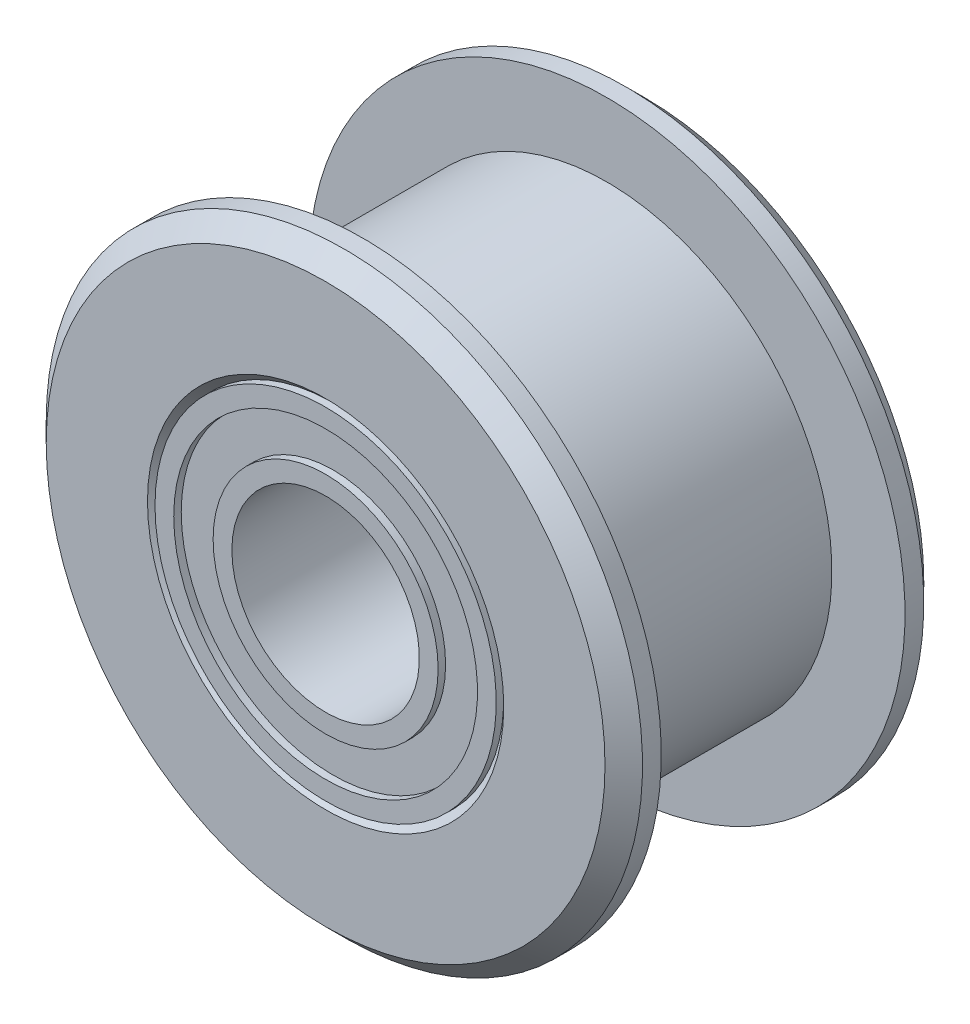
ISO-10303-21;
HEADER;
FILE_DESCRIPTION(('STEP AP214'),'2;1');
FILE_NAME('part.step','',(''),(''),'','','');
FILE_SCHEMA(('AUTOMOTIVE_DESIGN { 1 0 10303 214 1 1 1 1 }'));
ENDSEC;
DATA;
#1=APPLICATION_CONTEXT('core data for automotive mechanical design processes');
#2=APPLICATION_PROTOCOL_DEFINITION('international standard','automotive_design',2000,#1);
#3=PRODUCT_CONTEXT('',#1,'mechanical');
#4=PRODUCT('Part','Part','',(#3));
#5=PRODUCT_RELATED_PRODUCT_CATEGORY('part','',(#4));
#6=PRODUCT_DEFINITION_FORMATION('','',#4);
#7=PRODUCT_DEFINITION_CONTEXT('part definition',#1,'design');
#8=PRODUCT_DEFINITION('design','',#6,#7);
#9=PRODUCT_DEFINITION_SHAPE('','',#8);
#10=(LENGTH_UNIT() NAMED_UNIT(*) SI_UNIT(.MILLI.,.METRE.));
#11=(NAMED_UNIT(*) PLANE_ANGLE_UNIT() SI_UNIT($,.RADIAN.));
#12=(NAMED_UNIT(*) SI_UNIT($,.STERADIAN.) SOLID_ANGLE_UNIT());
#13=UNCERTAINTY_MEASURE_WITH_UNIT(LENGTH_MEASURE(1.E-05),#10,'distance_accuracy_value','');
#14=(GEOMETRIC_REPRESENTATION_CONTEXT(3) GLOBAL_UNCERTAINTY_ASSIGNED_CONTEXT((#13)) GLOBAL_UNIT_ASSIGNED_CONTEXT((#10,
#11,#12)) REPRESENTATION_CONTEXT('',''));
#15=CARTESIAN_POINT('',(0.,0.,0.));
#16=DIRECTION('',(0.,0.,1.));
#17=DIRECTION('',(1.,0.,0.));
#18=AXIS2_PLACEMENT_3D('',#15,#16,#17);
#19=CARTESIAN_POINT('',(0.,0.,6.5));
#20=DIRECTION('',(0.,0.,-1.));
#21=DIRECTION('',(0.,-1.,0.));
#22=AXIS2_PLACEMENT_3D('',#19,#20,#21);
#23=PLANE('',#22);
#24=CARTESIAN_POINT('',(0.,0.,6.5));
#25=DIRECTION('',(0.,0.,1.));
#26=DIRECTION('',(1.,0.,0.));
#27=AXIS2_PLACEMENT_3D('',#24,#25,#26);
#28=CIRCLE('',#27,6.);
#29=CARTESIAN_POINT('',(-6.,0.,6.5));
#30=VERTEX_POINT('',#29);
#31=EDGE_CURVE('E263',#30,#30,#28,.T.);
#32=ORIENTED_EDGE('',*,*,#31,.T.);
#33=EDGE_LOOP('',(#32));
#34=FACE_BOUND('',#33,.T.);
#35=CARTESIAN_POINT('',(0.,0.,6.5));
#36=DIRECTION('',(0.,0.,1.));
#37=DIRECTION('',(1.,0.,0.));
#38=AXIS2_PLACEMENT_3D('',#35,#36,#37);
#39=CIRCLE('',#38,7.95);
#40=CARTESIAN_POINT('',(-7.95,0.,6.5));
#41=VERTEX_POINT('',#40);
#42=EDGE_CURVE('E179',#41,#41,#39,.T.);
#43=ORIENTED_EDGE('',*,*,#42,.F.);
#44=EDGE_LOOP('',(#43));
#45=FACE_BOUND('',#44,.T.);
#46=ADVANCED_FACE('F19',(#34,#45),#23,.T.);
#47=CARTESIAN_POINT('',(0.,0.,0.));
#48=DIRECTION('',(0.,0.,1.));
#49=DIRECTION('',(1.,0.,0.));
#50=AXIS2_PLACEMENT_3D('',#47,#48,#49);
#51=CYLINDRICAL_SURFACE('',#50,2.5);
#52=CARTESIAN_POINT('',(0.,0.,7.5));
#53=DIRECTION('',(0.,0.,-1.));
#54=DIRECTION('',(1.,0.,0.));
#55=AXIS2_PLACEMENT_3D('',#52,#53,#54);
#56=CIRCLE('',#55,2.5);
#57=CARTESIAN_POINT('',(-2.5,0.,7.5));
#58=VERTEX_POINT('',#57);
#59=EDGE_CURVE('E167',#58,#58,#56,.T.);
#60=ORIENTED_EDGE('',*,*,#59,.F.);
#61=DIRECTION('',(0.,0.,-1.));
#62=VECTOR('',#61,1.);
#63=CARTESIAN_POINT('',(-2.5,0.,0.));
#64=LINE('',#63,#62);
#65=CARTESIAN_POINT('',(-2.5,0.,-1.));
#66=VERTEX_POINT('',#65);
#67=EDGE_CURVE('E11',#58,#66,#64,.T.);
#68=ORIENTED_EDGE('',*,*,#67,.T.);
#69=CARTESIAN_POINT('',(0.,0.,-1.));
#70=DIRECTION('',(0.,0.,-1.));
#71=DIRECTION('',(1.,0.,0.));
#72=AXIS2_PLACEMENT_3D('',#69,#70,#71);
#73=CIRCLE('',#72,2.5);
#74=EDGE_CURVE('E162',#66,#66,#73,.T.);
#75=ORIENTED_EDGE('',*,*,#74,.T.);
#76=ORIENTED_EDGE('',*,*,#67,.F.);
#77=EDGE_LOOP('',(#60,#68,#75,#76));
#78=FACE_BOUND('',#77,.T.);
#79=ADVANCED_FACE('F291',(#78),#51,.F.);
#80=CARTESIAN_POINT('',(0.,0.,7.5));
#81=DIRECTION('',(0.,0.,-1.));
#82=DIRECTION('',(1.,0.,0.));
#83=AXIS2_PLACEMENT_3D('',#80,#81,#82);
#84=CYLINDRICAL_SURFACE('',#83,3.);
#85=CARTESIAN_POINT('',(0.,0.,7.5));
#86=DIRECTION('',(0.,0.,1.));
#87=DIRECTION('',(1.,0.,0.));
#88=AXIS2_PLACEMENT_3D('',#85,#86,#87);
#89=CIRCLE('',#88,3.);
#90=CARTESIAN_POINT('',(-3.,0.,7.5));
#91=VERTEX_POINT('',#90);
#92=EDGE_CURVE('E164',#91,#91,#89,.T.);
#93=ORIENTED_EDGE('',*,*,#92,.F.);
#94=DIRECTION('',(0.,0.,-1.));
#95=VECTOR('',#94,1.);
#96=CARTESIAN_POINT('',(-3.,0.,7.5));
#97=LINE('',#96,#95);
#98=CARTESIAN_POINT('',(-3.,0.,7.3));
#99=VERTEX_POINT('',#98);
#100=EDGE_CURVE('E29',#91,#99,#97,.T.);
#101=ORIENTED_EDGE('',*,*,#100,.T.);
#102=CARTESIAN_POINT('',(0.,0.,7.3));
#103=DIRECTION('',(0.,0.,1.));
#104=DIRECTION('',(1.,0.,0.));
#105=AXIS2_PLACEMENT_3D('',#102,#103,#104);
#106=CIRCLE('',#105,3.);
#107=EDGE_CURVE('E251',#99,#99,#106,.T.);
#108=ORIENTED_EDGE('',*,*,#107,.T.);
#109=ORIENTED_EDGE('',*,*,#100,.F.);
#110=EDGE_LOOP('',(#93,#101,#108,#109));
#111=FACE_BOUND('',#110,.T.);
#112=ADVANCED_FACE('F333',(#111),#84,.T.);
#113=CARTESIAN_POINT('',(0.,0.,7.5));
#114=DIRECTION('',(0.,0.,-1.));
#115=DIRECTION('',(1.,0.,0.));
#116=AXIS2_PLACEMENT_3D('',#113,#114,#115);
#117=CYLINDRICAL_SURFACE('',#116,4.05);
#118=CARTESIAN_POINT('',(0.,0.,7.5));
#119=DIRECTION('',(0.,0.,-1.));
#120=DIRECTION('',(1.,0.,0.));
#121=AXIS2_PLACEMENT_3D('',#118,#119,#120);
#122=CIRCLE('',#121,4.05);
#123=CARTESIAN_POINT('',(-4.05,0.,7.5));
#124=VERTEX_POINT('',#123);
#125=EDGE_CURVE('E229',#124,#124,#122,.T.);
#126=ORIENTED_EDGE('',*,*,#125,.F.);
#127=DIRECTION('',(0.,0.,-1.));
#128=VECTOR('',#127,1.);
#129=CARTESIAN_POINT('',(-4.05,0.,7.5));
#130=LINE('',#129,#128);
#131=CARTESIAN_POINT('',(-4.05,0.,7.3));
#132=VERTEX_POINT('',#131);
#133=EDGE_CURVE('E172',#124,#132,#130,.T.);
#134=ORIENTED_EDGE('',*,*,#133,.T.);
#135=CARTESIAN_POINT('',(0.,0.,7.3));
#136=DIRECTION('',(0.,0.,-1.));
#137=DIRECTION('',(1.,0.,0.));
#138=AXIS2_PLACEMENT_3D('',#135,#136,#137);
#139=CIRCLE('',#138,4.05);
#140=EDGE_CURVE('E240',#132,#132,#139,.T.);
#141=ORIENTED_EDGE('',*,*,#140,.T.);
#142=ORIENTED_EDGE('',*,*,#133,.F.);
#143=EDGE_LOOP('',(#126,#134,#141,#142));
#144=FACE_BOUND('',#143,.T.);
#145=ADVANCED_FACE('F324',(#144),#117,.F.);
#146=CARTESIAN_POINT('',(0.,0.,7.3));
#147=DIRECTION('',(0.,0.,1.));
#148=DIRECTION('',(1.,0.,0.));
#149=AXIS2_PLACEMENT_3D('',#146,#147,#148);
#150=PLANE('',#149);
#151=ORIENTED_EDGE('',*,*,#107,.F.);
#152=EDGE_LOOP('',(#151));
#153=FACE_BOUND('',#152,.T.);
#154=ORIENTED_EDGE('',*,*,#140,.F.);
#155=EDGE_LOOP('',(#154));
#156=FACE_BOUND('',#155,.T.);
#157=ADVANCED_FACE('F315',(#153,#156),#150,.T.);
#158=CARTESIAN_POINT('',(0.,0.,7.5));
#159=DIRECTION('',(0.,0.,1.));
#160=DIRECTION('',(1.,0.,0.));
#161=AXIS2_PLACEMENT_3D('',#158,#159,#160);
#162=PLANE('',#161);
#163=ORIENTED_EDGE('',*,*,#125,.T.);
#164=EDGE_LOOP('',(#163));
#165=FACE_BOUND('',#164,.T.);
#166=CARTESIAN_POINT('',(0.,0.,7.5));
#167=DIRECTION('',(0.,0.,1.));
#168=DIRECTION('',(1.,0.,0.));
#169=AXIS2_PLACEMENT_3D('',#166,#167,#168);
#170=CIRCLE('',#169,4.55);
#171=CARTESIAN_POINT('',(-4.55,0.,7.5));
#172=VERTEX_POINT('',#171);
#173=EDGE_CURVE('E215',#172,#172,#170,.T.);
#174=ORIENTED_EDGE('',*,*,#173,.T.);
#175=EDGE_LOOP('',(#174));
#176=FACE_BOUND('',#175,.T.);
#177=ADVANCED_FACE('F313',(#165,#176),#162,.T.);
#178=CARTESIAN_POINT('',(0.,0.,7.4));
#179=DIRECTION('',(0.,0.,1.));
#180=DIRECTION('',(1.,0.,0.));
#181=AXIS2_PLACEMENT_3D('',#178,#179,#180);
#182=CONICAL_SURFACE('',#181,4.65,0.785398163397448);
#183=CARTESIAN_POINT('',(0.,0.,7.5));
#184=DIRECTION('',(0.,0.,-1.));
#185=DIRECTION('',(1.,0.,0.));
#186=AXIS2_PLACEMENT_3D('',#183,#184,#185);
#187=CIRCLE('',#186,4.75);
#188=CARTESIAN_POINT('',(-4.75,0.,7.5));
#189=VERTEX_POINT('',#188);
#190=EDGE_CURVE('E181',#189,#189,#187,.T.);
#191=ORIENTED_EDGE('',*,*,#190,.F.);
#192=DIRECTION('',(0.707106781186548,0.,-0.707106781186548));
#193=VECTOR('',#192,1.);
#194=CARTESIAN_POINT('',(-4.65,0.,7.4));
#195=LINE('',#194,#193);
#196=CARTESIAN_POINT('',(-4.55,0.,7.3));
#197=VERTEX_POINT('',#196);
#198=EDGE_CURVE('E227',#189,#197,#195,.T.);
#199=ORIENTED_EDGE('',*,*,#198,.T.);
#200=CARTESIAN_POINT('',(0.,0.,7.3));
#201=DIRECTION('',(0.,0.,1.));
#202=DIRECTION('',(1.,0.,0.));
#203=AXIS2_PLACEMENT_3D('',#200,#201,#202);
#204=CIRCLE('',#203,4.55);
#205=EDGE_CURVE('E230',#197,#197,#204,.T.);
#206=ORIENTED_EDGE('',*,*,#205,.F.);
#207=ORIENTED_EDGE('',*,*,#198,.F.);
#208=EDGE_LOOP('',(#191,#199,#206,#207));
#209=FACE_BOUND('',#208,.T.);
#210=ADVANCED_FACE('F309',(#209),#182,.F.);
#211=CARTESIAN_POINT('',(0.,0.,7.5));
#212=DIRECTION('',(0.,0.,-1.));
#213=DIRECTION('',(1.,0.,0.));
#214=AXIS2_PLACEMENT_3D('',#211,#212,#213);
#215=CYLINDRICAL_SURFACE('',#214,4.55);
#216=ORIENTED_EDGE('',*,*,#173,.F.);
#217=DIRECTION('',(0.,0.,-1.));
#218=VECTOR('',#217,1.);
#219=CARTESIAN_POINT('',(-4.55,0.,7.5));
#220=LINE('',#219,#218);
#221=EDGE_CURVE('E219',#172,#197,#220,.T.);
#222=ORIENTED_EDGE('',*,*,#221,.T.);
#223=ORIENTED_EDGE('',*,*,#205,.T.);
#224=ORIENTED_EDGE('',*,*,#221,.F.);
#225=EDGE_LOOP('',(#216,#222,#223,#224));
#226=FACE_BOUND('',#225,.T.);
#227=ADVANCED_FACE('F311',(#226),#215,.T.);
#228=CARTESIAN_POINT('',(0.,0.,7.5));
#229=DIRECTION('',(0.,0.,1.));
#230=DIRECTION('',(1.,0.,0.));
#231=AXIS2_PLACEMENT_3D('',#228,#229,#230);
#232=PLANE('',#231);
#233=ORIENTED_EDGE('',*,*,#59,.T.);
#234=EDGE_LOOP('',(#233));
#235=FACE_BOUND('',#234,.T.);
#236=ORIENTED_EDGE('',*,*,#92,.T.);
#237=EDGE_LOOP('',(#236));
#238=FACE_BOUND('',#237,.T.);
#239=ADVANCED_FACE('F288',(#235,#238),#232,.T.);
#240=CARTESIAN_POINT('',(0.,0.,0.));
#241=DIRECTION('',(0.,0.,1.));
#242=DIRECTION('',(1.,0.,0.));
#243=AXIS2_PLACEMENT_3D('',#240,#241,#242);
#244=CYLINDRICAL_SURFACE('',#243,6.);
#245=ORIENTED_EDGE('',*,*,#31,.F.);
#246=DIRECTION('',(0.,0.,-1.));
#247=VECTOR('',#246,1.);
#248=CARTESIAN_POINT('',(-6.,0.,0.));
#249=LINE('',#248,#247);
#250=CARTESIAN_POINT('',(-6.,0.,0.));
#251=VERTEX_POINT('',#250);
#252=EDGE_CURVE('E168',#30,#251,#249,.T.);
#253=ORIENTED_EDGE('',*,*,#252,.T.);
#254=CARTESIAN_POINT('',(0.,0.,0.));
#255=DIRECTION('',(0.,0.,1.));
#256=DIRECTION('',(1.,0.,0.));
#257=AXIS2_PLACEMENT_3D('',#254,#255,#256);
#258=CIRCLE('',#257,6.);
#259=EDGE_CURVE('E163',#251,#251,#258,.T.);
#260=ORIENTED_EDGE('',*,*,#259,.T.);
#261=ORIENTED_EDGE('',*,*,#252,.F.);
#262=EDGE_LOOP('',(#245,#253,#260,#261));
#263=FACE_BOUND('',#262,.T.);
#264=ADVANCED_FACE('F338',(#263),#244,.T.);
#265=CARTESIAN_POINT('',(0.,0.,-1.));
#266=DIRECTION('',(0.,0.,-1.));
#267=DIRECTION('',(1.,0.,0.));
#268=AXIS2_PLACEMENT_3D('',#265,#266,#267);
#269=CYLINDRICAL_SURFACE('',#268,3.);
#270=CARTESIAN_POINT('',(0.,0.,-1.));
#271=DIRECTION('',(0.,0.,1.));
#272=DIRECTION('',(1.,0.,0.));
#273=AXIS2_PLACEMENT_3D('',#270,#271,#272);
#274=CIRCLE('',#273,3.);
#275=CARTESIAN_POINT('',(-3.,0.,-1.));
#276=VERTEX_POINT('',#275);
#277=EDGE_CURVE('E158',#276,#276,#274,.T.);
#278=ORIENTED_EDGE('',*,*,#277,.T.);
#279=DIRECTION('',(0.,0.,1.));
#280=VECTOR('',#279,1.);
#281=CARTESIAN_POINT('',(-3.,0.,-1.));
#282=LINE('',#281,#280);
#283=CARTESIAN_POINT('',(-3.,0.,-0.8));
#284=VERTEX_POINT('',#283);
#285=EDGE_CURVE('E226',#276,#284,#282,.T.);
#286=ORIENTED_EDGE('',*,*,#285,.T.);
#287=CARTESIAN_POINT('',(0.,0.,-0.8));
#288=DIRECTION('',(0.,0.,1.));
#289=DIRECTION('',(1.,0.,0.));
#290=AXIS2_PLACEMENT_3D('',#287,#288,#289);
#291=CIRCLE('',#290,3.);
#292=EDGE_CURVE('E202',#284,#284,#291,.T.);
#293=ORIENTED_EDGE('',*,*,#292,.F.);
#294=ORIENTED_EDGE('',*,*,#285,.F.);
#295=EDGE_LOOP('',(#278,#286,#293,#294));
#296=FACE_BOUND('',#295,.T.);
#297=ADVANCED_FACE('F369',(#296),#269,.T.);
#298=CARTESIAN_POINT('',(0.,0.,-1.));
#299=DIRECTION('',(0.,0.,-1.));
#300=DIRECTION('',(1.,0.,0.));
#301=AXIS2_PLACEMENT_3D('',#298,#299,#300);
#302=CYLINDRICAL_SURFACE('',#301,4.05);
#303=CARTESIAN_POINT('',(0.,0.,-1.));
#304=DIRECTION('',(0.,0.,-1.));
#305=DIRECTION('',(1.,0.,0.));
#306=AXIS2_PLACEMENT_3D('',#303,#304,#305);
#307=CIRCLE('',#306,4.05);
#308=CARTESIAN_POINT('',(-4.05,0.,-1.));
#309=VERTEX_POINT('',#308);
#310=EDGE_CURVE('E190',#309,#309,#307,.T.);
#311=ORIENTED_EDGE('',*,*,#310,.T.);
#312=DIRECTION('',(0.,0.,1.));
#313=VECTOR('',#312,1.);
#314=CARTESIAN_POINT('',(-4.05,0.,-1.));
#315=LINE('',#314,#313);
#316=CARTESIAN_POINT('',(-4.05,0.,-0.8));
#317=VERTEX_POINT('',#316);
#318=EDGE_CURVE('E223',#309,#317,#315,.T.);
#319=ORIENTED_EDGE('',*,*,#318,.T.);
#320=CARTESIAN_POINT('',(0.,0.,-0.8));
#321=DIRECTION('',(0.,0.,-1.));
#322=DIRECTION('',(1.,0.,0.));
#323=AXIS2_PLACEMENT_3D('',#320,#321,#322);
#324=CIRCLE('',#323,4.05);
#325=EDGE_CURVE('E193',#317,#317,#324,.T.);
#326=ORIENTED_EDGE('',*,*,#325,.F.);
#327=ORIENTED_EDGE('',*,*,#318,.F.);
#328=EDGE_LOOP('',(#311,#319,#326,#327));
#329=FACE_BOUND('',#328,.T.);
#330=ADVANCED_FACE('F21',(#329),#302,.F.);
#331=CARTESIAN_POINT('',(0.,0.,-0.8));
#332=DIRECTION('',(0.,0.,1.));
#333=DIRECTION('',(1.,0.,0.));
#334=AXIS2_PLACEMENT_3D('',#331,#332,#333);
#335=PLANE('',#334);
#336=ORIENTED_EDGE('',*,*,#292,.T.);
#337=EDGE_LOOP('',(#336));
#338=FACE_BOUND('',#337,.T.);
#339=ORIENTED_EDGE('',*,*,#325,.T.);
#340=EDGE_LOOP('',(#339));
#341=FACE_BOUND('',#340,.T.);
#342=ADVANCED_FACE('F468',(#338,#341),#335,.F.);
#343=CARTESIAN_POINT('',(0.,0.,-1.));
#344=DIRECTION('',(0.,0.,1.));
#345=DIRECTION('',(1.,0.,0.));
#346=AXIS2_PLACEMENT_3D('',#343,#344,#345);
#347=PLANE('',#346);
#348=ORIENTED_EDGE('',*,*,#310,.F.);
#349=EDGE_LOOP('',(#348));
#350=FACE_BOUND('',#349,.T.);
#351=CARTESIAN_POINT('',(0.,0.,-1.));
#352=DIRECTION('',(0.,0.,1.));
#353=DIRECTION('',(1.,0.,0.));
#354=AXIS2_PLACEMENT_3D('',#351,#352,#353);
#355=CIRCLE('',#354,4.55);
#356=CARTESIAN_POINT('',(-4.55,0.,-1.));
#357=VERTEX_POINT('',#356);
#358=EDGE_CURVE('E257',#357,#357,#355,.T.);
#359=ORIENTED_EDGE('',*,*,#358,.F.);
#360=EDGE_LOOP('',(#359));
#361=FACE_BOUND('',#360,.T.);
#362=ADVANCED_FACE('F359',(#350,#361),#347,.F.);
#363=CARTESIAN_POINT('',(0.,0.,-0.9));
#364=DIRECTION('',(0.,0.,-1.));
#365=DIRECTION('',(1.,0.,0.));
#366=AXIS2_PLACEMENT_3D('',#363,#364,#365);
#367=CONICAL_SURFACE('',#366,4.65,0.785398163397448);
#368=CARTESIAN_POINT('',(0.,0.,-1.));
#369=DIRECTION('',(0.,0.,-1.));
#370=DIRECTION('',(1.,0.,0.));
#371=AXIS2_PLACEMENT_3D('',#368,#369,#370);
#372=CIRCLE('',#371,4.75);
#373=CARTESIAN_POINT('',(-4.75,0.,-1.));
#374=VERTEX_POINT('',#373);
#375=EDGE_CURVE('E183',#374,#374,#372,.T.);
#376=ORIENTED_EDGE('',*,*,#375,.T.);
#377=DIRECTION('',(0.707106781186548,0.,0.707106781186548));
#378=VECTOR('',#377,1.);
#379=CARTESIAN_POINT('',(-4.65,0.,-0.9));
#380=LINE('',#379,#378);
#381=CARTESIAN_POINT('',(-4.55,0.,-0.8));
#382=VERTEX_POINT('',#381);
#383=EDGE_CURVE('E194',#374,#382,#380,.T.);
#384=ORIENTED_EDGE('',*,*,#383,.T.);
#385=CARTESIAN_POINT('',(0.,0.,-0.8));
#386=DIRECTION('',(0.,0.,1.));
#387=DIRECTION('',(1.,0.,0.));
#388=AXIS2_PLACEMENT_3D('',#385,#386,#387);
#389=CIRCLE('',#388,4.55);
#390=EDGE_CURVE('E204',#382,#382,#389,.T.);
#391=ORIENTED_EDGE('',*,*,#390,.T.);
#392=ORIENTED_EDGE('',*,*,#383,.F.);
#393=EDGE_LOOP('',(#376,#384,#391,#392));
#394=FACE_BOUND('',#393,.T.);
#395=ADVANCED_FACE('F505',(#394),#367,.F.);
#396=CARTESIAN_POINT('',(0.,0.,-1.));
#397=DIRECTION('',(0.,0.,-1.));
#398=DIRECTION('',(1.,0.,0.));
#399=AXIS2_PLACEMENT_3D('',#396,#397,#398);
#400=CYLINDRICAL_SURFACE('',#399,4.55);
#401=ORIENTED_EDGE('',*,*,#358,.T.);
#402=DIRECTION('',(0.,0.,1.));
#403=VECTOR('',#402,1.);
#404=CARTESIAN_POINT('',(-4.55,0.,-1.));
#405=LINE('',#404,#403);
#406=EDGE_CURVE('E211',#357,#382,#405,.T.);
#407=ORIENTED_EDGE('',*,*,#406,.T.);
#408=ORIENTED_EDGE('',*,*,#390,.F.);
#409=ORIENTED_EDGE('',*,*,#406,.F.);
#410=EDGE_LOOP('',(#401,#407,#408,#409));
#411=FACE_BOUND('',#410,.T.);
#412=ADVANCED_FACE('F500',(#411),#400,.T.);
#413=CARTESIAN_POINT('',(0.,0.,-1.));
#414=DIRECTION('',(0.,0.,1.));
#415=DIRECTION('',(1.,0.,0.));
#416=AXIS2_PLACEMENT_3D('',#413,#414,#415);
#417=PLANE('',#416);
#418=ORIENTED_EDGE('',*,*,#74,.F.);
#419=EDGE_LOOP('',(#418));
#420=FACE_BOUND('',#419,.T.);
#421=ORIENTED_EDGE('',*,*,#277,.F.);
#422=EDGE_LOOP('',(#421));
#423=FACE_BOUND('',#422,.T.);
#424=ADVANCED_FACE('F366',(#420,#423),#417,.F.);
#425=CARTESIAN_POINT('',(0.,0.,0.));
#426=DIRECTION('',(0.,0.,-1.));
#427=DIRECTION('',(0.,-1.,0.));
#428=AXIS2_PLACEMENT_3D('',#425,#426,#427);
#429=PLANE('',#428);
#430=ORIENTED_EDGE('',*,*,#259,.F.);
#431=EDGE_LOOP('',(#430));
#432=FACE_BOUND('',#431,.T.);
#433=CARTESIAN_POINT('',(0.,0.,0.));
#434=DIRECTION('',(0.,0.,1.));
#435=DIRECTION('',(1.,0.,0.));
#436=AXIS2_PLACEMENT_3D('',#433,#434,#435);
#437=CIRCLE('',#436,7.95);
#438=CARTESIAN_POINT('',(-7.95,0.,0.));
#439=VERTEX_POINT('',#438);
#440=EDGE_CURVE('E137',#439,#439,#437,.T.);
#441=ORIENTED_EDGE('',*,*,#440,.T.);
#442=EDGE_LOOP('',(#441));
#443=FACE_BOUND('',#442,.T.);
#444=ADVANCED_FACE('F364',(#432,#443),#429,.F.);
#445=CARTESIAN_POINT('',(0.,0.,7.5));
#446=DIRECTION('',(0.,0.,1.));
#447=DIRECTION('',(1.,0.,0.));
#448=AXIS2_PLACEMENT_3D('',#445,#446,#447);
#449=PLANE('',#448);
#450=ORIENTED_EDGE('',*,*,#190,.T.);
#451=EDGE_LOOP('',(#450));
#452=FACE_BOUND('',#451,.T.);
#453=CARTESIAN_POINT('',(0.,0.,7.5));
#454=DIRECTION('',(0.,0.,-1.));
#455=DIRECTION('',(1.,0.,0.));
#456=AXIS2_PLACEMENT_3D('',#453,#454,#455);
#457=CIRCLE('',#456,7.45);
#458=CARTESIAN_POINT('',(-7.45,0.,7.5));
#459=VERTEX_POINT('',#458);
#460=EDGE_CURVE('E187',#459,#459,#457,.T.);
#461=ORIENTED_EDGE('',*,*,#460,.F.);
#462=EDGE_LOOP('',(#461));
#463=FACE_BOUND('',#462,.T.);
#464=ADVANCED_FACE('F307',(#452,#463),#449,.T.);
#465=CARTESIAN_POINT('',(0.,0.,6.5));
#466=DIRECTION('',(0.,0.,1.));
#467=DIRECTION('',(1.,0.,0.));
#468=AXIS2_PLACEMENT_3D('',#465,#466,#467);
#469=CYLINDRICAL_SURFACE('',#468,7.95);
#470=CARTESIAN_POINT('',(0.,0.,7.));
#471=DIRECTION('',(0.,0.,1.));
#472=DIRECTION('',(1.,0.,0.));
#473=AXIS2_PLACEMENT_3D('',#470,#471,#472);
#474=CIRCLE('',#473,7.95);
#475=CARTESIAN_POINT('',(-7.95,0.,7.));
#476=VERTEX_POINT('',#475);
#477=EDGE_CURVE('E173',#476,#476,#474,.T.);
#478=ORIENTED_EDGE('',*,*,#477,.F.);
#479=DIRECTION('',(0.,0.,-1.));
#480=VECTOR('',#479,1.);
#481=CARTESIAN_POINT('',(-7.95,0.,6.5));
#482=LINE('',#481,#480);
#483=EDGE_CURVE('E177',#476,#41,#482,.T.);
#484=ORIENTED_EDGE('',*,*,#483,.T.);
#485=ORIENTED_EDGE('',*,*,#42,.T.);
#486=ORIENTED_EDGE('',*,*,#483,.F.);
#487=EDGE_LOOP('',(#478,#484,#485,#486));
#488=FACE_BOUND('',#487,.T.);
#489=ADVANCED_FACE('F352',(#488),#469,.T.);
#490=CARTESIAN_POINT('',(0.,0.,7.25));
#491=DIRECTION('',(0.,0.,-1.));
#492=DIRECTION('',(1.,0.,0.));
#493=AXIS2_PLACEMENT_3D('',#490,#491,#492);
#494=CONICAL_SURFACE('',#493,7.7,0.785398163397448);
#495=ORIENTED_EDGE('',*,*,#460,.T.);
#496=DIRECTION('',(-0.707106781186548,0.,-0.707106781186548));
#497=VECTOR('',#496,1.);
#498=CARTESIAN_POINT('',(-7.7,0.,7.25));
#499=LINE('',#498,#497);
#500=EDGE_CURVE('E178',#459,#476,#499,.T.);
#501=ORIENTED_EDGE('',*,*,#500,.T.);
#502=ORIENTED_EDGE('',*,*,#477,.T.);
#503=ORIENTED_EDGE('',*,*,#500,.F.);
#504=EDGE_LOOP('',(#495,#501,#502,#503));
#505=FACE_BOUND('',#504,.T.);
#506=ADVANCED_FACE('F346',(#505),#494,.T.);
#507=CARTESIAN_POINT('',(0.,0.,-1.));
#508=DIRECTION('',(0.,0.,1.));
#509=DIRECTION('',(1.,0.,0.));
#510=AXIS2_PLACEMENT_3D('',#507,#508,#509);
#511=PLANE('',#510);
#512=ORIENTED_EDGE('',*,*,#375,.F.);
#513=EDGE_LOOP('',(#512));
#514=FACE_BOUND('',#513,.T.);
#515=CARTESIAN_POINT('',(0.,0.,-1.));
#516=DIRECTION('',(0.,0.,1.));
#517=DIRECTION('',(1.,0.,0.));
#518=AXIS2_PLACEMENT_3D('',#515,#516,#517);
#519=CIRCLE('',#518,7.45);
#520=CARTESIAN_POINT('',(-7.45,0.,-1.));
#521=VERTEX_POINT('',#520);
#522=EDGE_CURVE('E139',#521,#521,#519,.T.);
#523=ORIENTED_EDGE('',*,*,#522,.F.);
#524=EDGE_LOOP('',(#523));
#525=FACE_BOUND('',#524,.T.);
#526=ADVANCED_FACE('F340',(#514,#525),#511,.F.);
#527=CARTESIAN_POINT('',(0.,0.,0.));
#528=DIRECTION('',(0.,0.,1.));
#529=DIRECTION('',(1.,0.,0.));
#530=AXIS2_PLACEMENT_3D('',#527,#528,#529);
#531=CYLINDRICAL_SURFACE('',#530,7.95);
#532=CARTESIAN_POINT('',(0.,0.,-0.5));
#533=DIRECTION('',(0.,0.,-1.));
#534=DIRECTION('',(1.,0.,0.));
#535=AXIS2_PLACEMENT_3D('',#532,#533,#534);
#536=CIRCLE('',#535,7.95);
#537=CARTESIAN_POINT('',(-7.95,0.,-0.5));
#538=VERTEX_POINT('',#537);
#539=EDGE_CURVE('E136',#538,#538,#536,.T.);
#540=ORIENTED_EDGE('',*,*,#539,.F.);
#541=DIRECTION('',(0.,0.,1.));
#542=VECTOR('',#541,1.);
#543=CARTESIAN_POINT('',(-7.95,0.,0.));
#544=LINE('',#543,#542);
#545=EDGE_CURVE('E132',#538,#439,#544,.T.);
#546=ORIENTED_EDGE('',*,*,#545,.T.);
#547=ORIENTED_EDGE('',*,*,#440,.F.);
#548=ORIENTED_EDGE('',*,*,#545,.F.);
#549=EDGE_LOOP('',(#540,#546,#547,#548));
#550=FACE_BOUND('',#549,.T.);
#551=ADVANCED_FACE('F134',(#550),#531,.T.);
#552=CARTESIAN_POINT('',(0.,0.,-0.75));
#553=DIRECTION('',(0.,0.,1.));
#554=DIRECTION('',(1.,0.,0.));
#555=AXIS2_PLACEMENT_3D('',#552,#553,#554);
#556=CONICAL_SURFACE('',#555,7.7,0.785398163397449);
#557=ORIENTED_EDGE('',*,*,#539,.T.);
#558=DIRECTION('',(0.707106781186548,0.,-0.707106781186547));
#559=VECTOR('',#558,1.);
#560=CARTESIAN_POINT('',(-7.7,0.,-0.75));
#561=LINE('',#560,#559);
#562=EDGE_CURVE('E143',#538,#521,#561,.T.);
#563=ORIENTED_EDGE('',*,*,#562,.T.);
#564=ORIENTED_EDGE('',*,*,#522,.T.);
#565=ORIENTED_EDGE('',*,*,#562,.F.);
#566=EDGE_LOOP('',(#557,#563,#564,#565));
#567=FACE_BOUND('',#566,.T.);
#568=ADVANCED_FACE('F144',(#567),#556,.T.);
#569=CLOSED_SHELL('',(#46,#79,#112,#145,#157,#177,#210,#227,#239,#264,#297,#330,#342,#362,#395,
#412,#424,#444,#464,#489,#506,#526,#551,#568));
#570=MANIFOLD_SOLID_BREP('B1',#569);
#571=ADVANCED_BREP_SHAPE_REPRESENTATION('',(#18,#570),#14);
#572=SHAPE_DEFINITION_REPRESENTATION(#9,#571);
ENDSEC;
END-ISO-10303-21;
